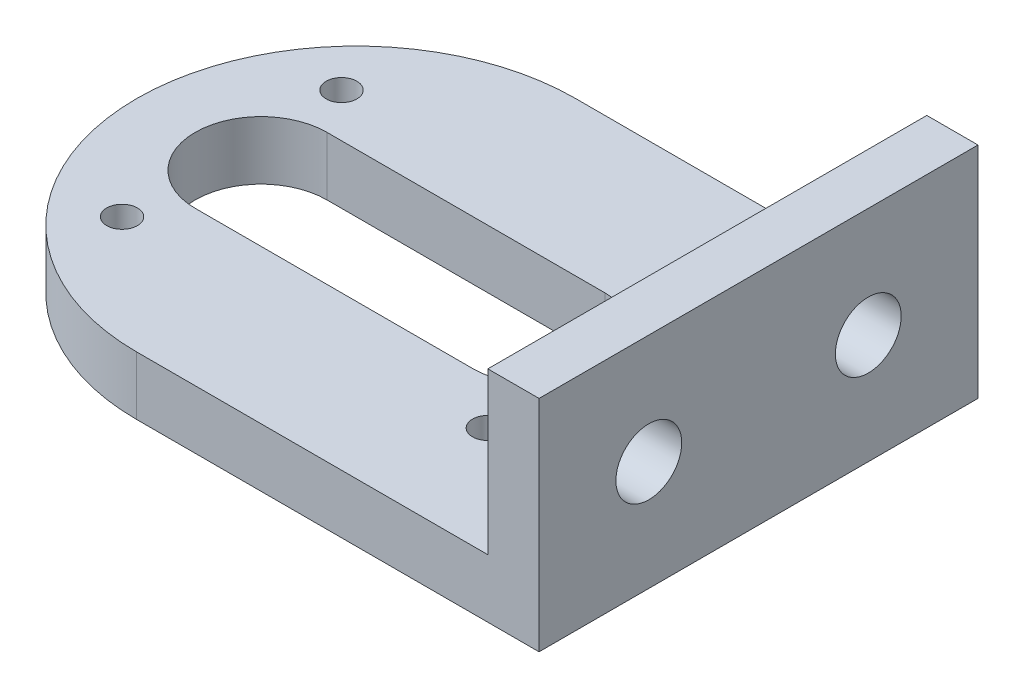
ISO-10303-21;
HEADER;
FILE_DESCRIPTION(('STEP AP214'),'2;1');
FILE_NAME('part.step','',(''),(''),'','','');
FILE_SCHEMA(('AUTOMOTIVE_DESIGN { 1 0 10303 214 1 1 1 1 }'));
ENDSEC;
DATA;
#1=APPLICATION_CONTEXT('core data for automotive mechanical design processes');
#2=APPLICATION_PROTOCOL_DEFINITION('international standard','automotive_design',2000,#1);
#3=PRODUCT_CONTEXT('',#1,'mechanical');
#4=PRODUCT('Part','Part','',(#3));
#5=PRODUCT_RELATED_PRODUCT_CATEGORY('part','',(#4));
#6=PRODUCT_DEFINITION_FORMATION('','',#4);
#7=PRODUCT_DEFINITION_CONTEXT('part definition',#1,'design');
#8=PRODUCT_DEFINITION('design','',#6,#7);
#9=PRODUCT_DEFINITION_SHAPE('','',#8);
#10=(LENGTH_UNIT() NAMED_UNIT(*) SI_UNIT(.MILLI.,.METRE.));
#11=(NAMED_UNIT(*) PLANE_ANGLE_UNIT() SI_UNIT($,.RADIAN.));
#12=(NAMED_UNIT(*) SI_UNIT($,.STERADIAN.) SOLID_ANGLE_UNIT());
#13=UNCERTAINTY_MEASURE_WITH_UNIT(LENGTH_MEASURE(1.E-05),#10,'distance_accuracy_value','');
#14=(GEOMETRIC_REPRESENTATION_CONTEXT(3) GLOBAL_UNCERTAINTY_ASSIGNED_CONTEXT((#13)) GLOBAL_UNIT_ASSIGNED_CONTEXT((#10,
#11,#12)) REPRESENTATION_CONTEXT('',''));
#15=CARTESIAN_POINT('',(0.,0.,0.));
#16=DIRECTION('',(0.,0.,1.));
#17=DIRECTION('',(1.,0.,0.));
#18=AXIS2_PLACEMENT_3D('',#15,#16,#17);
#19=CARTESIAN_POINT('',(40.25,8.,-30.));
#20=DIRECTION('',(-1.,0.,0.));
#21=DIRECTION('',(0.,0.,1.));
#22=AXIS2_PLACEMENT_3D('',#19,#20,#21);
#23=PLANE('',#22);
#24=CARTESIAN_POINT('',(40.25,15.,15.));
#25=DIRECTION('',(1.,0.,0.));
#26=DIRECTION('',(0.,0.,-1.));
#27=AXIS2_PLACEMENT_3D('',#24,#25,#26);
#28=CIRCLE('',#27,4.5);
#29=CARTESIAN_POINT('',(40.25,15.,10.5));
#30=VERTEX_POINT('',#29);
#31=EDGE_CURVE('E166',#30,#30,#28,.T.);
#32=ORIENTED_EDGE('',*,*,#31,.F.);
#33=EDGE_LOOP('',(#32));
#34=FACE_BOUND('',#33,.T.);
#35=CARTESIAN_POINT('',(40.25,15.,-15.));
#36=DIRECTION('',(1.,0.,0.));
#37=DIRECTION('',(0.,0.,-1.));
#38=AXIS2_PLACEMENT_3D('',#35,#36,#37);
#39=CIRCLE('',#38,4.5);
#40=CARTESIAN_POINT('',(40.25,15.,-19.5));
#41=VERTEX_POINT('',#40);
#42=EDGE_CURVE('E170',#41,#41,#39,.T.);
#43=ORIENTED_EDGE('',*,*,#42,.F.);
#44=EDGE_LOOP('',(#43));
#45=FACE_BOUND('',#44,.T.);
#46=DIRECTION('',(0.,0.,-1.));
#47=VECTOR('',#46,1.);
#48=CARTESIAN_POINT('',(40.25,0.,-30.));
#49=LINE('',#48,#47);
#50=CARTESIAN_POINT('',(40.25,0.,30.));
#51=VERTEX_POINT('',#50);
#52=CARTESIAN_POINT('',(40.25,0.,-30.));
#53=VERTEX_POINT('',#52);
#54=EDGE_CURVE('E204',#51,#53,#49,.T.);
#55=ORIENTED_EDGE('',*,*,#54,.T.);
#56=DIRECTION('',(0.,-1.,0.));
#57=VECTOR('',#56,1.);
#58=CARTESIAN_POINT('',(40.25,8.,-30.));
#59=LINE('',#58,#57);
#60=CARTESIAN_POINT('',(40.25,30.,-30.));
#61=VERTEX_POINT('',#60);
#62=EDGE_CURVE('E11',#61,#53,#59,.T.);
#63=ORIENTED_EDGE('',*,*,#62,.F.);
#64=DIRECTION('',(0.,0.,-1.));
#65=VECTOR('',#64,1.);
#66=CARTESIAN_POINT('',(40.25,30.,-30.));
#67=LINE('',#66,#65);
#68=CARTESIAN_POINT('',(40.25,30.,30.));
#69=VERTEX_POINT('',#68);
#70=EDGE_CURVE('E179',#69,#61,#67,.T.);
#71=ORIENTED_EDGE('',*,*,#70,.F.);
#72=DIRECTION('',(0.,-1.,0.));
#73=VECTOR('',#72,1.);
#74=CARTESIAN_POINT('',(40.25,8.,30.));
#75=LINE('',#74,#73);
#76=EDGE_CURVE('E215',#69,#51,#75,.T.);
#77=ORIENTED_EDGE('',*,*,#76,.T.);
#78=EDGE_LOOP('',(#55,#63,#71,#77));
#79=FACE_BOUND('',#78,.T.);
#80=ADVANCED_FACE('F42',(#34,#45,#79),#23,.F.);
#81=CARTESIAN_POINT('',(-14.75,8.,-30.));
#82=DIRECTION('',(0.,0.,1.));
#83=DIRECTION('',(1.,0.,0.));
#84=AXIS2_PLACEMENT_3D('',#81,#82,#83);
#85=PLANE('',#84);
#86=DIRECTION('',(-1.,0.,0.));
#87=VECTOR('',#86,1.);
#88=CARTESIAN_POINT('',(-14.75,0.,-30.));
#89=LINE('',#88,#87);
#90=CARTESIAN_POINT('',(-14.75,0.,-30.));
#91=VERTEX_POINT('',#90);
#92=EDGE_CURVE('E219',#53,#91,#89,.T.);
#93=ORIENTED_EDGE('',*,*,#92,.T.);
#94=DIRECTION('',(0.,-1.,0.));
#95=VECTOR('',#94,1.);
#96=CARTESIAN_POINT('',(-14.75,8.,-30.));
#97=LINE('',#96,#95);
#98=CARTESIAN_POINT('',(-14.75,8.,-30.));
#99=VERTEX_POINT('',#98);
#100=EDGE_CURVE('E51',#99,#91,#97,.T.);
#101=ORIENTED_EDGE('',*,*,#100,.F.);
#102=DIRECTION('',(-1.,0.,0.));
#103=VECTOR('',#102,1.);
#104=CARTESIAN_POINT('',(-14.75,8.,-30.));
#105=LINE('',#104,#103);
#106=CARTESIAN_POINT('',(33.25,8.,-30.));
#107=VERTEX_POINT('',#106);
#108=EDGE_CURVE('E205',#107,#99,#105,.T.);
#109=ORIENTED_EDGE('',*,*,#108,.F.);
#110=DIRECTION('',(0.,-1.,0.));
#111=VECTOR('',#110,1.);
#112=CARTESIAN_POINT('',(33.25,30.,-30.));
#113=LINE('',#112,#111);
#114=CARTESIAN_POINT('',(33.25,30.,-30.));
#115=VERTEX_POINT('',#114);
#116=EDGE_CURVE('E200',#115,#107,#113,.T.);
#117=ORIENTED_EDGE('',*,*,#116,.F.);
#118=DIRECTION('',(-1.,0.,0.));
#119=VECTOR('',#118,1.);
#120=CARTESIAN_POINT('',(40.25,30.,-30.));
#121=LINE('',#120,#119);
#122=EDGE_CURVE('E183',#61,#115,#121,.T.);
#123=ORIENTED_EDGE('',*,*,#122,.F.);
#124=ORIENTED_EDGE('',*,*,#62,.T.);
#125=EDGE_LOOP('',(#93,#101,#109,#117,#123,#124));
#126=FACE_BOUND('',#125,.T.);
#127=ADVANCED_FACE('F262',(#126),#85,.F.);
#128=CARTESIAN_POINT('',(-14.75,8.,0.));
#129=DIRECTION('',(0.,-1.,0.));
#130=DIRECTION('',(0.,0.,-1.));
#131=AXIS2_PLACEMENT_3D('',#128,#129,#130);
#132=CYLINDRICAL_SURFACE('',#131,30.);
#133=CARTESIAN_POINT('',(-14.75,0.,0.));
#134=DIRECTION('',(0.,1.,0.));
#135=DIRECTION('',(0.,0.,1.));
#136=AXIS2_PLACEMENT_3D('',#133,#134,#135);
#137=CIRCLE('',#136,30.);
#138=CARTESIAN_POINT('',(-14.75,0.,30.));
#139=VERTEX_POINT('',#138);
#140=EDGE_CURVE('E222',#91,#139,#137,.T.);
#141=ORIENTED_EDGE('',*,*,#140,.T.);
#142=DIRECTION('',(0.,-1.,0.));
#143=VECTOR('',#142,1.);
#144=CARTESIAN_POINT('',(-14.75,8.,30.));
#145=LINE('',#144,#143);
#146=CARTESIAN_POINT('',(-14.75,8.,30.));
#147=VERTEX_POINT('',#146);
#148=EDGE_CURVE('E230',#147,#139,#145,.T.);
#149=ORIENTED_EDGE('',*,*,#148,.F.);
#150=CARTESIAN_POINT('',(-14.75,8.,0.));
#151=DIRECTION('',(0.,1.,0.));
#152=DIRECTION('',(0.,0.,1.));
#153=AXIS2_PLACEMENT_3D('',#150,#151,#152);
#154=CIRCLE('',#153,30.);
#155=EDGE_CURVE('E208',#99,#147,#154,.T.);
#156=ORIENTED_EDGE('',*,*,#155,.F.);
#157=ORIENTED_EDGE('',*,*,#100,.T.);
#158=EDGE_LOOP('',(#141,#149,#156,#157));
#159=FACE_BOUND('',#158,.T.);
#160=ADVANCED_FACE('F240',(#159),#132,.T.);
#161=CARTESIAN_POINT('',(-14.75,8.,30.));
#162=DIRECTION('',(0.,0.,-1.));
#163=DIRECTION('',(-1.,0.,0.));
#164=AXIS2_PLACEMENT_3D('',#161,#162,#163);
#165=PLANE('',#164);
#166=DIRECTION('',(1.,0.,0.));
#167=VECTOR('',#166,1.);
#168=CARTESIAN_POINT('',(-14.75,0.,30.));
#169=LINE('',#168,#167);
#170=EDGE_CURVE('E209',#139,#51,#169,.T.);
#171=ORIENTED_EDGE('',*,*,#170,.T.);
#172=ORIENTED_EDGE('',*,*,#76,.F.);
#173=DIRECTION('',(1.,0.,0.));
#174=VECTOR('',#173,1.);
#175=CARTESIAN_POINT('',(40.25,30.,30.));
#176=LINE('',#175,#174);
#177=CARTESIAN_POINT('',(33.25,30.,30.));
#178=VERTEX_POINT('',#177);
#179=EDGE_CURVE('E189',#178,#69,#176,.T.);
#180=ORIENTED_EDGE('',*,*,#179,.F.);
#181=DIRECTION('',(0.,-1.,0.));
#182=VECTOR('',#181,1.);
#183=CARTESIAN_POINT('',(33.25,30.,30.));
#184=LINE('',#183,#182);
#185=CARTESIAN_POINT('',(33.25,8.,30.));
#186=VERTEX_POINT('',#185);
#187=EDGE_CURVE('E193',#178,#186,#184,.T.);
#188=ORIENTED_EDGE('',*,*,#187,.T.);
#189=DIRECTION('',(1.,0.,0.));
#190=VECTOR('',#189,1.);
#191=CARTESIAN_POINT('',(-14.75,8.,30.));
#192=LINE('',#191,#190);
#193=EDGE_CURVE('E212',#147,#186,#192,.T.);
#194=ORIENTED_EDGE('',*,*,#193,.F.);
#195=ORIENTED_EDGE('',*,*,#148,.T.);
#196=EDGE_LOOP('',(#171,#172,#180,#188,#194,#195));
#197=FACE_BOUND('',#196,.T.);
#198=ADVANCED_FACE('F247',(#197),#165,.F.);
#199=CARTESIAN_POINT('',(-14.75,8.,0.));
#200=DIRECTION('',(0.,1.,0.));
#201=DIRECTION('',(0.,0.,1.));
#202=AXIS2_PLACEMENT_3D('',#199,#200,#201);
#203=PLANE('',#202);
#204=CARTESIAN_POINT('',(-31.75,8.,15.));
#205=DIRECTION('',(0.,1.,0.));
#206=DIRECTION('',(0.,0.,1.));
#207=AXIS2_PLACEMENT_3D('',#204,#205,#206);
#208=CIRCLE('',#207,2.1);
#209=CARTESIAN_POINT('',(-31.75,8.,17.1));
#210=VERTEX_POINT('',#209);
#211=EDGE_CURVE('E323',#210,#210,#208,.T.);
#212=ORIENTED_EDGE('',*,*,#211,.F.);
#213=EDGE_LOOP('',(#212));
#214=FACE_BOUND('',#213,.T.);
#215=CARTESIAN_POINT('',(18.25,8.,15.));
#216=DIRECTION('',(0.,1.,0.));
#217=DIRECTION('',(0.,0.,1.));
#218=AXIS2_PLACEMENT_3D('',#215,#216,#217);
#219=CIRCLE('',#218,2.1);
#220=CARTESIAN_POINT('',(18.25,8.,17.1));
#221=VERTEX_POINT('',#220);
#222=EDGE_CURVE('E336',#221,#221,#219,.T.);
#223=ORIENTED_EDGE('',*,*,#222,.F.);
#224=EDGE_LOOP('',(#223));
#225=FACE_BOUND('',#224,.T.);
#226=CARTESIAN_POINT('',(18.25,8.,-15.));
#227=DIRECTION('',(0.,1.,0.));
#228=DIRECTION('',(0.,0.,1.));
#229=AXIS2_PLACEMENT_3D('',#226,#227,#228);
#230=CIRCLE('',#229,2.1);
#231=CARTESIAN_POINT('',(18.25,8.,-12.9));
#232=VERTEX_POINT('',#231);
#233=EDGE_CURVE('E344',#232,#232,#230,.T.);
#234=ORIENTED_EDGE('',*,*,#233,.F.);
#235=EDGE_LOOP('',(#234));
#236=FACE_BOUND('',#235,.T.);
#237=CARTESIAN_POINT('',(-31.75,8.,-15.));
#238=DIRECTION('',(0.,1.,0.));
#239=DIRECTION('',(0.,0.,1.));
#240=AXIS2_PLACEMENT_3D('',#237,#238,#239);
#241=CIRCLE('',#240,2.1);
#242=CARTESIAN_POINT('',(-31.75,8.,-12.9));
#243=VERTEX_POINT('',#242);
#244=EDGE_CURVE('E352',#243,#243,#241,.T.);
#245=ORIENTED_EDGE('',*,*,#244,.F.);
#246=EDGE_LOOP('',(#245));
#247=FACE_BOUND('',#246,.T.);
#248=CARTESIAN_POINT('',(-27.75,8.,0.));
#249=DIRECTION('',(0.,1.,0.));
#250=DIRECTION('',(0.,0.,1.));
#251=AXIS2_PLACEMENT_3D('',#248,#249,#250);
#252=CIRCLE('',#251,9.);
#253=CARTESIAN_POINT('',(-27.75,8.,-9.));
#254=VERTEX_POINT('',#253);
#255=CARTESIAN_POINT('',(-27.75,8.,9.));
#256=VERTEX_POINT('',#255);
#257=EDGE_CURVE('E163',#254,#256,#252,.T.);
#258=ORIENTED_EDGE('',*,*,#257,.F.);
#259=DIRECTION('',(-1.,0.,0.));
#260=VECTOR('',#259,1.);
#261=CARTESIAN_POINT('',(-14.75,8.,-9.));
#262=LINE('',#261,#260);
#263=CARTESIAN_POINT('',(10.25,8.,-9.));
#264=VERTEX_POINT('',#263);
#265=EDGE_CURVE('E151',#264,#254,#262,.T.);
#266=ORIENTED_EDGE('',*,*,#265,.F.);
#267=CARTESIAN_POINT('',(10.25,8.,0.));
#268=DIRECTION('',(0.,1.,0.));
#269=DIRECTION('',(0.,0.,1.));
#270=AXIS2_PLACEMENT_3D('',#267,#268,#269);
#271=CIRCLE('',#270,9.);
#272=CARTESIAN_POINT('',(10.25,8.,9.));
#273=VERTEX_POINT('',#272);
#274=EDGE_CURVE('E126',#273,#264,#271,.T.);
#275=ORIENTED_EDGE('',*,*,#274,.F.);
#276=DIRECTION('',(1.,0.,0.));
#277=VECTOR('',#276,1.);
#278=CARTESIAN_POINT('',(-14.75,8.,9.));
#279=LINE('',#278,#277);
#280=EDGE_CURVE('E160',#256,#273,#279,.T.);
#281=ORIENTED_EDGE('',*,*,#280,.F.);
#282=EDGE_LOOP('',(#258,#266,#275,#281));
#283=FACE_BOUND('',#282,.T.);
#284=DIRECTION('',(0.,0.,1.));
#285=VECTOR('',#284,1.);
#286=CARTESIAN_POINT('',(33.25,8.,-30.));
#287=LINE('',#286,#285);
#288=EDGE_CURVE('E178',#107,#186,#287,.T.);
#289=ORIENTED_EDGE('',*,*,#288,.F.);
#290=ORIENTED_EDGE('',*,*,#108,.T.);
#291=ORIENTED_EDGE('',*,*,#155,.T.);
#292=ORIENTED_EDGE('',*,*,#193,.T.);
#293=EDGE_LOOP('',(#289,#290,#291,#292));
#294=FACE_BOUND('',#293,.T.);
#295=ADVANCED_FACE('F261',(#214,#225,#236,#247,#283,#294),#203,.T.);
#296=CARTESIAN_POINT('',(-14.75,0.,0.));
#297=DIRECTION('',(0.,1.,0.));
#298=DIRECTION('',(0.,0.,1.));
#299=AXIS2_PLACEMENT_3D('',#296,#297,#298);
#300=PLANE('',#299);
#301=CARTESIAN_POINT('',(-31.75,0.,15.));
#302=DIRECTION('',(0.,-1.,0.));
#303=DIRECTION('',(0.,0.,-1.));
#304=AXIS2_PLACEMENT_3D('',#301,#302,#303);
#305=CIRCLE('',#304,2.1);
#306=CARTESIAN_POINT('',(-31.75,0.,12.9));
#307=VERTEX_POINT('',#306);
#308=EDGE_CURVE('E326',#307,#307,#305,.T.);
#309=ORIENTED_EDGE('',*,*,#308,.F.);
#310=EDGE_LOOP('',(#309));
#311=FACE_BOUND('',#310,.T.);
#312=CARTESIAN_POINT('',(18.25,0.,15.));
#313=DIRECTION('',(0.,-1.,0.));
#314=DIRECTION('',(0.,0.,-1.));
#315=AXIS2_PLACEMENT_3D('',#312,#313,#314);
#316=CIRCLE('',#315,2.1);
#317=CARTESIAN_POINT('',(18.25,0.,12.9));
#318=VERTEX_POINT('',#317);
#319=EDGE_CURVE('E330',#318,#318,#316,.T.);
#320=ORIENTED_EDGE('',*,*,#319,.F.);
#321=EDGE_LOOP('',(#320));
#322=FACE_BOUND('',#321,.T.);
#323=CARTESIAN_POINT('',(18.25,0.,-15.));
#324=DIRECTION('',(0.,-1.,0.));
#325=DIRECTION('',(0.,0.,-1.));
#326=AXIS2_PLACEMENT_3D('',#323,#324,#325);
#327=CIRCLE('',#326,2.1);
#328=CARTESIAN_POINT('',(18.25,0.,-17.1));
#329=VERTEX_POINT('',#328);
#330=EDGE_CURVE('E340',#329,#329,#327,.T.);
#331=ORIENTED_EDGE('',*,*,#330,.F.);
#332=EDGE_LOOP('',(#331));
#333=FACE_BOUND('',#332,.T.);
#334=CARTESIAN_POINT('',(-31.75,0.,-15.));
#335=DIRECTION('',(0.,-1.,0.));
#336=DIRECTION('',(0.,0.,-1.));
#337=AXIS2_PLACEMENT_3D('',#334,#335,#336);
#338=CIRCLE('',#337,2.1);
#339=CARTESIAN_POINT('',(-31.75,0.,-17.1));
#340=VERTEX_POINT('',#339);
#341=EDGE_CURVE('E348',#340,#340,#338,.T.);
#342=ORIENTED_EDGE('',*,*,#341,.F.);
#343=EDGE_LOOP('',(#342));
#344=FACE_BOUND('',#343,.T.);
#345=DIRECTION('',(1.,0.,0.));
#346=VECTOR('',#345,1.);
#347=CARTESIAN_POINT('',(-27.75,0.,-9.));
#348=LINE('',#347,#346);
#349=CARTESIAN_POINT('',(-27.75,0.,-9.));
#350=VERTEX_POINT('',#349);
#351=CARTESIAN_POINT('',(10.25,0.,-9.));
#352=VERTEX_POINT('',#351);
#353=EDGE_CURVE('E133',#350,#352,#348,.T.);
#354=ORIENTED_EDGE('',*,*,#353,.F.);
#355=CARTESIAN_POINT('',(-27.75,0.,0.));
#356=DIRECTION('',(0.,-1.,0.));
#357=DIRECTION('',(0.,0.,-1.));
#358=AXIS2_PLACEMENT_3D('',#355,#356,#357);
#359=CIRCLE('',#358,9.);
#360=CARTESIAN_POINT('',(-27.75,0.,9.));
#361=VERTEX_POINT('',#360);
#362=EDGE_CURVE('E66',#361,#350,#359,.T.);
#363=ORIENTED_EDGE('',*,*,#362,.F.);
#364=DIRECTION('',(-1.,0.,0.));
#365=VECTOR('',#364,1.);
#366=CARTESIAN_POINT('',(-27.75,0.,9.));
#367=LINE('',#366,#365);
#368=CARTESIAN_POINT('',(10.25,0.,9.));
#369=VERTEX_POINT('',#368);
#370=EDGE_CURVE('E141',#369,#361,#367,.T.);
#371=ORIENTED_EDGE('',*,*,#370,.F.);
#372=CARTESIAN_POINT('',(10.25,0.,0.));
#373=DIRECTION('',(0.,-1.,0.));
#374=DIRECTION('',(0.,0.,-1.));
#375=AXIS2_PLACEMENT_3D('',#372,#373,#374);
#376=CIRCLE('',#375,9.);
#377=EDGE_CURVE('E123',#352,#369,#376,.T.);
#378=ORIENTED_EDGE('',*,*,#377,.F.);
#379=EDGE_LOOP('',(#354,#363,#371,#378));
#380=FACE_BOUND('',#379,.T.);
#381=ORIENTED_EDGE('',*,*,#54,.F.);
#382=ORIENTED_EDGE('',*,*,#170,.F.);
#383=ORIENTED_EDGE('',*,*,#140,.F.);
#384=ORIENTED_EDGE('',*,*,#92,.F.);
#385=EDGE_LOOP('',(#381,#382,#383,#384));
#386=FACE_BOUND('',#385,.T.);
#387=ADVANCED_FACE('F138',(#311,#322,#333,#344,#380,#386),#300,.F.);
#388=CARTESIAN_POINT('',(33.25,30.,-30.));
#389=DIRECTION('',(1.,0.,0.));
#390=DIRECTION('',(0.,0.,-1.));
#391=AXIS2_PLACEMENT_3D('',#388,#389,#390);
#392=PLANE('',#391);
#393=CARTESIAN_POINT('',(33.25,15.,15.));
#394=DIRECTION('',(1.,0.,0.));
#395=DIRECTION('',(0.,0.,-1.));
#396=AXIS2_PLACEMENT_3D('',#393,#394,#395);
#397=CIRCLE('',#396,4.49999999999999);
#398=CARTESIAN_POINT('',(33.25,15.,10.5));
#399=VERTEX_POINT('',#398);
#400=EDGE_CURVE('E45',#399,#399,#397,.T.);
#401=ORIENTED_EDGE('',*,*,#400,.T.);
#402=EDGE_LOOP('',(#401));
#403=FACE_BOUND('',#402,.T.);
#404=CARTESIAN_POINT('',(33.25,15.,-15.));
#405=DIRECTION('',(1.,0.,0.));
#406=DIRECTION('',(0.,0.,-1.));
#407=AXIS2_PLACEMENT_3D('',#404,#405,#406);
#408=CIRCLE('',#407,4.49999999999999);
#409=CARTESIAN_POINT('',(33.25,15.,-19.5));
#410=VERTEX_POINT('',#409);
#411=EDGE_CURVE('E174',#410,#410,#408,.T.);
#412=ORIENTED_EDGE('',*,*,#411,.T.);
#413=EDGE_LOOP('',(#412));
#414=FACE_BOUND('',#413,.T.);
#415=ORIENTED_EDGE('',*,*,#288,.T.);
#416=ORIENTED_EDGE('',*,*,#187,.F.);
#417=DIRECTION('',(0.,0.,1.));
#418=VECTOR('',#417,1.);
#419=CARTESIAN_POINT('',(33.25,30.,-30.));
#420=LINE('',#419,#418);
#421=EDGE_CURVE('E186',#115,#178,#420,.T.);
#422=ORIENTED_EDGE('',*,*,#421,.F.);
#423=ORIENTED_EDGE('',*,*,#116,.T.);
#424=EDGE_LOOP('',(#415,#416,#422,#423));
#425=FACE_BOUND('',#424,.T.);
#426=ADVANCED_FACE('F259',(#403,#414,#425),#392,.F.);
#427=CARTESIAN_POINT('',(0.,30.,0.));
#428=DIRECTION('',(0.,-1.,0.));
#429=DIRECTION('',(0.,0.,-1.));
#430=AXIS2_PLACEMENT_3D('',#427,#428,#429);
#431=PLANE('',#430);
#432=ORIENTED_EDGE('',*,*,#70,.T.);
#433=ORIENTED_EDGE('',*,*,#122,.T.);
#434=ORIENTED_EDGE('',*,*,#421,.T.);
#435=ORIENTED_EDGE('',*,*,#179,.T.);
#436=EDGE_LOOP('',(#432,#433,#434,#435));
#437=FACE_BOUND('',#436,.T.);
#438=ADVANCED_FACE('F254',(#437),#431,.F.);
#439=CARTESIAN_POINT('',(40.25,15.,-15.));
#440=DIRECTION('',(1.,0.,0.));
#441=DIRECTION('',(0.,0.,-1.));
#442=AXIS2_PLACEMENT_3D('',#439,#440,#441);
#443=CYLINDRICAL_SURFACE('',#442,4.49999999999999);
#444=ORIENTED_EDGE('',*,*,#42,.T.);
#445=EDGE_LOOP('',(#444));
#446=FACE_BOUND('',#445,.T.);
#447=ORIENTED_EDGE('',*,*,#411,.F.);
#448=EDGE_LOOP('',(#447));
#449=FACE_BOUND('',#448,.T.);
#450=ADVANCED_FACE('F284',(#446,#449),#443,.F.);
#451=CARTESIAN_POINT('',(40.25,15.,15.));
#452=DIRECTION('',(1.,0.,0.));
#453=DIRECTION('',(0.,0.,-1.));
#454=AXIS2_PLACEMENT_3D('',#451,#452,#453);
#455=CYLINDRICAL_SURFACE('',#454,4.49999999999999);
#456=ORIENTED_EDGE('',*,*,#31,.T.);
#457=EDGE_LOOP('',(#456));
#458=FACE_BOUND('',#457,.T.);
#459=ORIENTED_EDGE('',*,*,#400,.F.);
#460=EDGE_LOOP('',(#459));
#461=FACE_BOUND('',#460,.T.);
#462=ADVANCED_FACE('F287',(#458,#461),#455,.F.);
#463=CARTESIAN_POINT('',(-27.75,22.,0.));
#464=DIRECTION('',(0.,-1.,0.));
#465=DIRECTION('',(0.,0.,-1.));
#466=AXIS2_PLACEMENT_3D('',#463,#464,#465);
#467=CYLINDRICAL_SURFACE('',#466,9.);
#468=ORIENTED_EDGE('',*,*,#257,.T.);
#469=DIRECTION('',(0.,-1.,0.));
#470=VECTOR('',#469,1.);
#471=CARTESIAN_POINT('',(-27.75,22.,9.));
#472=LINE('',#471,#470);
#473=EDGE_CURVE('E148',#256,#361,#472,.T.);
#474=ORIENTED_EDGE('',*,*,#473,.T.);
#475=ORIENTED_EDGE('',*,*,#362,.T.);
#476=DIRECTION('',(0.,-1.,0.));
#477=VECTOR('',#476,1.);
#478=CARTESIAN_POINT('',(-27.75,22.,-9.));
#479=LINE('',#478,#477);
#480=EDGE_CURVE('E130',#254,#350,#479,.T.);
#481=ORIENTED_EDGE('',*,*,#480,.F.);
#482=EDGE_LOOP('',(#468,#474,#475,#481));
#483=FACE_BOUND('',#482,.T.);
#484=ADVANCED_FACE('F291',(#483),#467,.F.);
#485=CARTESIAN_POINT('',(-27.75,22.,9.));
#486=DIRECTION('',(0.,0.,1.));
#487=DIRECTION('',(1.,0.,0.));
#488=AXIS2_PLACEMENT_3D('',#485,#486,#487);
#489=PLANE('',#488);
#490=ORIENTED_EDGE('',*,*,#280,.T.);
#491=DIRECTION('',(0.,-1.,0.));
#492=VECTOR('',#491,1.);
#493=CARTESIAN_POINT('',(10.25,22.,9.));
#494=LINE('',#493,#492);
#495=EDGE_CURVE('E129',#273,#369,#494,.T.);
#496=ORIENTED_EDGE('',*,*,#495,.T.);
#497=ORIENTED_EDGE('',*,*,#370,.T.);
#498=ORIENTED_EDGE('',*,*,#473,.F.);
#499=EDGE_LOOP('',(#490,#496,#497,#498));
#500=FACE_BOUND('',#499,.T.);
#501=ADVANCED_FACE('F295',(#500),#489,.F.);
#502=CARTESIAN_POINT('',(10.25,22.,0.));
#503=DIRECTION('',(0.,-1.,0.));
#504=DIRECTION('',(0.,0.,-1.));
#505=AXIS2_PLACEMENT_3D('',#502,#503,#504);
#506=CYLINDRICAL_SURFACE('',#505,9.);
#507=ORIENTED_EDGE('',*,*,#274,.T.);
#508=DIRECTION('',(0.,-1.,0.));
#509=VECTOR('',#508,1.);
#510=CARTESIAN_POINT('',(10.25,22.,-9.));
#511=LINE('',#510,#509);
#512=EDGE_CURVE('E58',#264,#352,#511,.T.);
#513=ORIENTED_EDGE('',*,*,#512,.T.);
#514=ORIENTED_EDGE('',*,*,#377,.T.);
#515=ORIENTED_EDGE('',*,*,#495,.F.);
#516=EDGE_LOOP('',(#507,#513,#514,#515));
#517=FACE_BOUND('',#516,.T.);
#518=ADVANCED_FACE('F120',(#517),#506,.F.);
#519=CARTESIAN_POINT('',(-27.75,22.,-9.));
#520=DIRECTION('',(0.,0.,-1.));
#521=DIRECTION('',(-1.,0.,0.));
#522=AXIS2_PLACEMENT_3D('',#519,#520,#521);
#523=PLANE('',#522);
#524=ORIENTED_EDGE('',*,*,#265,.T.);
#525=ORIENTED_EDGE('',*,*,#480,.T.);
#526=ORIENTED_EDGE('',*,*,#353,.T.);
#527=ORIENTED_EDGE('',*,*,#512,.F.);
#528=EDGE_LOOP('',(#524,#525,#526,#527));
#529=FACE_BOUND('',#528,.T.);
#530=ADVANCED_FACE('F134',(#529),#523,.F.);
#531=CARTESIAN_POINT('',(-31.75,0.,-15.));
#532=DIRECTION('',(0.,-1.,0.));
#533=DIRECTION('',(0.,0.,-1.));
#534=AXIS2_PLACEMENT_3D('',#531,#532,#533);
#535=CYLINDRICAL_SURFACE('',#534,2.1);
#536=ORIENTED_EDGE('',*,*,#244,.T.);
#537=EDGE_LOOP('',(#536));
#538=FACE_BOUND('',#537,.T.);
#539=ORIENTED_EDGE('',*,*,#341,.T.);
#540=EDGE_LOOP('',(#539));
#541=FACE_BOUND('',#540,.T.);
#542=ADVANCED_FACE('F298',(#538,#541),#535,.F.);
#543=CARTESIAN_POINT('',(18.25,0.,-15.));
#544=DIRECTION('',(0.,-1.,0.));
#545=DIRECTION('',(0.,0.,-1.));
#546=AXIS2_PLACEMENT_3D('',#543,#544,#545);
#547=CYLINDRICAL_SURFACE('',#546,2.1);
#548=ORIENTED_EDGE('',*,*,#233,.T.);
#549=EDGE_LOOP('',(#548));
#550=FACE_BOUND('',#549,.T.);
#551=ORIENTED_EDGE('',*,*,#330,.T.);
#552=EDGE_LOOP('',(#551));
#553=FACE_BOUND('',#552,.T.);
#554=ADVANCED_FACE('F306',(#550,#553),#547,.F.);
#555=CARTESIAN_POINT('',(18.25,0.,15.));
#556=DIRECTION('',(0.,-1.,0.));
#557=DIRECTION('',(0.,0.,-1.));
#558=AXIS2_PLACEMENT_3D('',#555,#556,#557);
#559=CYLINDRICAL_SURFACE('',#558,2.1);
#560=ORIENTED_EDGE('',*,*,#222,.T.);
#561=EDGE_LOOP('',(#560));
#562=FACE_BOUND('',#561,.T.);
#563=ORIENTED_EDGE('',*,*,#319,.T.);
#564=EDGE_LOOP('',(#563));
#565=FACE_BOUND('',#564,.T.);
#566=ADVANCED_FACE('F310',(#562,#565),#559,.F.);
#567=CARTESIAN_POINT('',(-31.75,0.,15.));
#568=DIRECTION('',(0.,-1.,0.));
#569=DIRECTION('',(0.,0.,-1.));
#570=AXIS2_PLACEMENT_3D('',#567,#568,#569);
#571=CYLINDRICAL_SURFACE('',#570,2.1);
#572=ORIENTED_EDGE('',*,*,#211,.T.);
#573=EDGE_LOOP('',(#572));
#574=FACE_BOUND('',#573,.T.);
#575=ORIENTED_EDGE('',*,*,#308,.T.);
#576=EDGE_LOOP('',(#575));
#577=FACE_BOUND('',#576,.T.);
#578=ADVANCED_FACE('F314',(#574,#577),#571,.F.);
#579=CLOSED_SHELL('',(#80,#127,#160,#198,#295,#387,#426,#438,#450,#462,#484,#501,#518,#530,#542,
#554,#566,#578));
#580=MANIFOLD_SOLID_BREP('B2',#579);
#581=ADVANCED_BREP_SHAPE_REPRESENTATION('',(#18,#580),#14);
#582=SHAPE_DEFINITION_REPRESENTATION(#9,#581);
ENDSEC;
END-ISO-10303-21;
